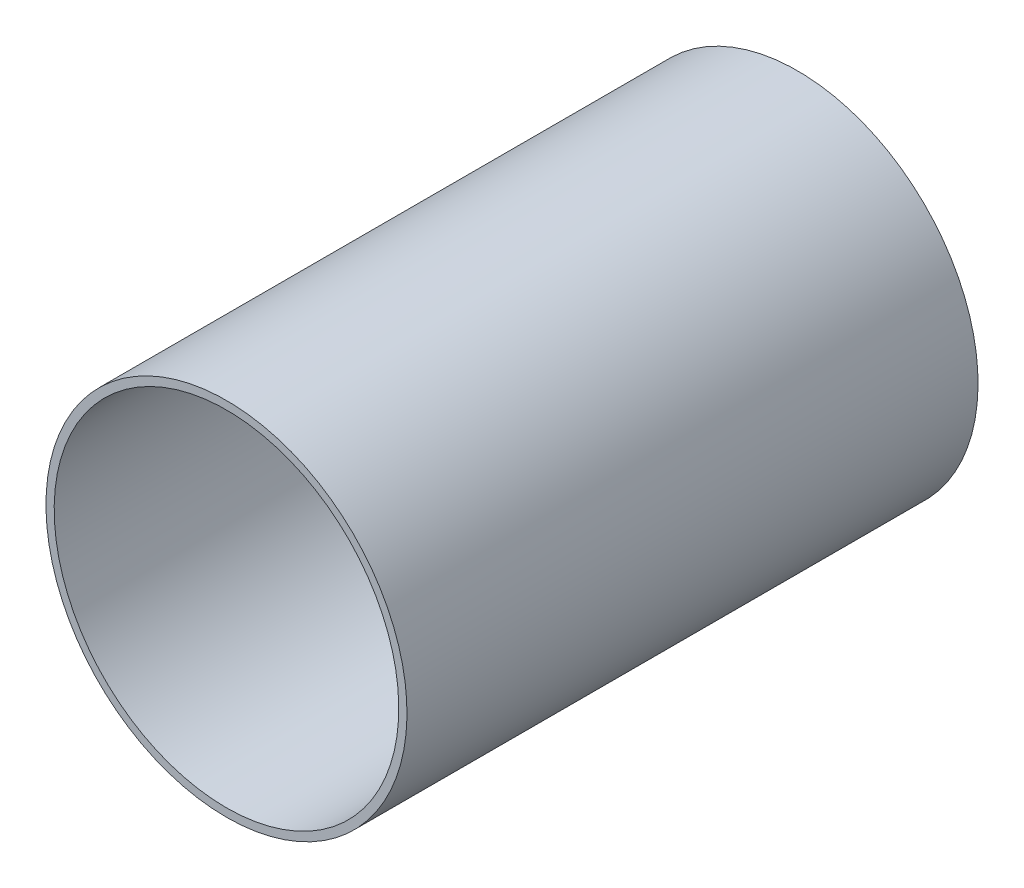
ISO-10303-21;
HEADER;
FILE_DESCRIPTION(('STEP AP214'),'2;1');
FILE_NAME('part.step','',(''),(''),'','','');
FILE_SCHEMA(('AUTOMOTIVE_DESIGN { 1 0 10303 214 1 1 1 1 }'));
ENDSEC;
DATA;
#1=APPLICATION_CONTEXT('core data for automotive mechanical design processes');
#2=APPLICATION_PROTOCOL_DEFINITION('international standard','automotive_design',2000,#1);
#3=PRODUCT_CONTEXT('',#1,'mechanical');
#4=PRODUCT('Part','Part','',(#3));
#5=PRODUCT_RELATED_PRODUCT_CATEGORY('part','',(#4));
#6=PRODUCT_DEFINITION_FORMATION('','',#4);
#7=PRODUCT_DEFINITION_CONTEXT('part definition',#1,'design');
#8=PRODUCT_DEFINITION('design','',#6,#7);
#9=PRODUCT_DEFINITION_SHAPE('','',#8);
#10=(LENGTH_UNIT() NAMED_UNIT(*) SI_UNIT(.MILLI.,.METRE.));
#11=(NAMED_UNIT(*) PLANE_ANGLE_UNIT() SI_UNIT($,.RADIAN.));
#12=(NAMED_UNIT(*) SI_UNIT($,.STERADIAN.) SOLID_ANGLE_UNIT());
#13=UNCERTAINTY_MEASURE_WITH_UNIT(LENGTH_MEASURE(1.E-05),#10,'distance_accuracy_value','');
#14=(GEOMETRIC_REPRESENTATION_CONTEXT(3) GLOBAL_UNCERTAINTY_ASSIGNED_CONTEXT((#13)) GLOBAL_UNIT_ASSIGNED_CONTEXT((#10,
#11,#12)) REPRESENTATION_CONTEXT('',''));
#15=CARTESIAN_POINT('',(0.,0.,0.));
#16=DIRECTION('',(0.,0.,1.));
#17=DIRECTION('',(1.,0.,0.));
#18=AXIS2_PLACEMENT_3D('',#15,#16,#17);
#19=CARTESIAN_POINT('',(123.952,-121.234,-0.045));
#20=DIRECTION('',(0.,0.,-1.));
#21=DIRECTION('',(0.,-1.,0.));
#22=AXIS2_PLACEMENT_3D('',#19,#20,#21);
#23=CYLINDRICAL_SURFACE('',#22,0.525);
#24=CARTESIAN_POINT('',(123.952,-121.234,-0.035));
#25=DIRECTION('',(0.,0.,-1.));
#26=DIRECTION('',(0.,-1.,0.));
#27=AXIS2_PLACEMENT_3D('',#24,#25,#26);
#28=CIRCLE('',#27,0.525);
#29=CARTESIAN_POINT('',(123.952,-121.759,-0.035));
#30=VERTEX_POINT('',#29);
#31=EDGE_CURVE('E66',#30,#30,#28,.T.);
#32=ORIENTED_EDGE('',*,*,#31,.T.);
#33=DIRECTION('',(0.,0.,1.));
#34=VECTOR('',#33,1.);
#35=CARTESIAN_POINT('',(123.952,-121.759,-0.045));
#36=LINE('',#35,#34);
#37=CARTESIAN_POINT('',(123.952,-121.759,1.705));
#38=VERTEX_POINT('',#37);
#39=EDGE_CURVE('E11',#30,#38,#36,.T.);
#40=ORIENTED_EDGE('',*,*,#39,.T.);
#41=CARTESIAN_POINT('',(123.952,-121.234,1.705));
#42=DIRECTION('',(0.,0.,-1.));
#43=DIRECTION('',(0.,-1.,0.));
#44=AXIS2_PLACEMENT_3D('',#41,#42,#43);
#45=CIRCLE('',#44,0.525);
#46=EDGE_CURVE('E21',#38,#38,#45,.T.);
#47=ORIENTED_EDGE('',*,*,#46,.F.);
#48=ORIENTED_EDGE('',*,*,#39,.F.);
#49=EDGE_LOOP('',(#32,#40,#47,#48));
#50=FACE_BOUND('',#49,.T.);
#51=ADVANCED_FACE('F17',(#50),#23,.F.);
#52=CARTESIAN_POINT('',(123.952,-121.784,1.705));
#53=DIRECTION('',(0.,0.,1.));
#54=DIRECTION('',(1.,0.,0.));
#55=AXIS2_PLACEMENT_3D('',#52,#53,#54);
#56=PLANE('',#55);
#57=ORIENTED_EDGE('',*,*,#46,.T.);
#58=EDGE_LOOP('',(#57));
#59=FACE_BOUND('',#58,.T.);
#60=CARTESIAN_POINT('',(123.952,-121.234,1.705));
#61=DIRECTION('',(0.,0.,1.));
#62=DIRECTION('',(0.,-1.,0.));
#63=AXIS2_PLACEMENT_3D('',#60,#61,#62);
#64=CIRCLE('',#63,0.55);
#65=CARTESIAN_POINT('',(123.952,-121.784,1.705));
#66=VERTEX_POINT('',#65);
#67=EDGE_CURVE('E58',#66,#66,#64,.T.);
#68=ORIENTED_EDGE('',*,*,#67,.T.);
#69=EDGE_LOOP('',(#68));
#70=FACE_BOUND('',#69,.T.);
#71=ADVANCED_FACE('F77',(#59,#70),#56,.T.);
#72=CARTESIAN_POINT('',(123.952,-121.784,-0.035));
#73=DIRECTION('',(0.,0.,1.));
#74=DIRECTION('',(1.,0.,0.));
#75=AXIS2_PLACEMENT_3D('',#72,#73,#74);
#76=PLANE('',#75);
#77=ORIENTED_EDGE('',*,*,#31,.F.);
#78=EDGE_LOOP('',(#77));
#79=FACE_BOUND('',#78,.T.);
#80=CARTESIAN_POINT('',(123.952,-121.234,-0.035));
#81=DIRECTION('',(0.,0.,1.));
#82=DIRECTION('',(0.,-1.,0.));
#83=AXIS2_PLACEMENT_3D('',#80,#81,#82);
#84=CIRCLE('',#83,0.55);
#85=CARTESIAN_POINT('',(123.952,-121.784,-0.035));
#86=VERTEX_POINT('',#85);
#87=EDGE_CURVE('E57',#86,#86,#84,.T.);
#88=ORIENTED_EDGE('',*,*,#87,.F.);
#89=EDGE_LOOP('',(#88));
#90=FACE_BOUND('',#89,.T.);
#91=ADVANCED_FACE('F19',(#79,#90),#76,.F.);
#92=CARTESIAN_POINT('',(123.952,-121.234,-0.035));
#93=DIRECTION('',(0.,0.,-1.));
#94=DIRECTION('',(0.,-1.,0.));
#95=AXIS2_PLACEMENT_3D('',#92,#93,#94);
#96=CYLINDRICAL_SURFACE('',#95,0.55);
#97=ORIENTED_EDGE('',*,*,#87,.T.);
#98=DIRECTION('',(0.,0.,1.));
#99=VECTOR('',#98,1.);
#100=CARTESIAN_POINT('',(123.952,-121.784,-0.035));
#101=LINE('',#100,#99);
#102=EDGE_CURVE('E54',#86,#66,#101,.T.);
#103=ORIENTED_EDGE('',*,*,#102,.T.);
#104=ORIENTED_EDGE('',*,*,#67,.F.);
#105=ORIENTED_EDGE('',*,*,#102,.F.);
#106=EDGE_LOOP('',(#97,#103,#104,#105));
#107=FACE_BOUND('',#106,.T.);
#108=ADVANCED_FACE('F55',(#107),#96,.T.);
#109=CLOSED_SHELL('',(#51,#71,#91,#108));
#110=MANIFOLD_SOLID_BREP('B1',#109);
#111=ADVANCED_BREP_SHAPE_REPRESENTATION('',(#18,#110),#14);
#112=SHAPE_DEFINITION_REPRESENTATION(#9,#111);
ENDSEC;
END-ISO-10303-21;
